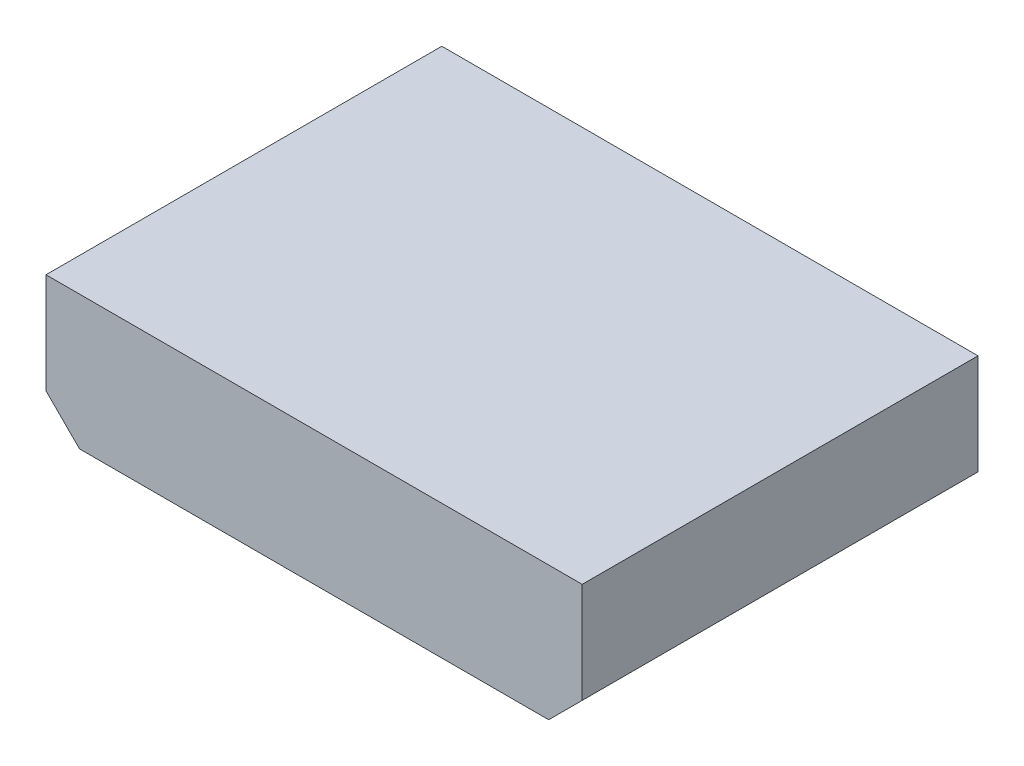
ISO-10303-21;
HEADER;
FILE_DESCRIPTION(('STEP AP214'),'2;1');
FILE_NAME('part.step','',(''),(''),'','','');
FILE_SCHEMA(('AUTOMOTIVE_DESIGN { 1 0 10303 214 1 1 1 1 }'));
ENDSEC;
DATA;
#1=APPLICATION_CONTEXT('core data for automotive mechanical design processes');
#2=APPLICATION_PROTOCOL_DEFINITION('international standard','automotive_design',2000,#1);
#3=PRODUCT_CONTEXT('',#1,'mechanical');
#4=PRODUCT('Part','Part','',(#3));
#5=PRODUCT_RELATED_PRODUCT_CATEGORY('part','',(#4));
#6=PRODUCT_DEFINITION_FORMATION('','',#4);
#7=PRODUCT_DEFINITION_CONTEXT('part definition',#1,'design');
#8=PRODUCT_DEFINITION('design','',#6,#7);
#9=PRODUCT_DEFINITION_SHAPE('','',#8);
#10=(LENGTH_UNIT() NAMED_UNIT(*) SI_UNIT(.MILLI.,.METRE.));
#11=(NAMED_UNIT(*) PLANE_ANGLE_UNIT() SI_UNIT($,.RADIAN.));
#12=(NAMED_UNIT(*) SI_UNIT($,.STERADIAN.) SOLID_ANGLE_UNIT());
#13=UNCERTAINTY_MEASURE_WITH_UNIT(LENGTH_MEASURE(1.E-05),#10,'distance_accuracy_value','');
#14=(GEOMETRIC_REPRESENTATION_CONTEXT(3) GLOBAL_UNCERTAINTY_ASSIGNED_CONTEXT((#13)) GLOBAL_UNIT_ASSIGNED_CONTEXT((#10,
#11,#12)) REPRESENTATION_CONTEXT('',''));
#15=CARTESIAN_POINT('',(0.,0.,0.));
#16=DIRECTION('',(0.,0.,1.));
#17=DIRECTION('',(1.,0.,0.));
#18=AXIS2_PLACEMENT_3D('',#15,#16,#17);
#19=CARTESIAN_POINT('',(10.16,0.,-2.));
#20=DIRECTION('',(0.,0.,1.));
#21=DIRECTION('',(1.,0.,0.));
#22=AXIS2_PLACEMENT_3D('',#19,#20,#21);
#23=CYLINDRICAL_SURFACE('',#22,0.25);
#24=CARTESIAN_POINT('',(10.16,0.,-2.));
#25=DIRECTION('',(0.,0.,1.));
#26=DIRECTION('',(1.,0.,0.));
#27=AXIS2_PLACEMENT_3D('',#24,#25,#26);
#28=CIRCLE('',#27,0.25);
#29=CARTESIAN_POINT('',(10.41,0.,-2.));
#30=VERTEX_POINT('',#29);
#31=EDGE_CURVE('E11',#30,#30,#28,.T.);
#32=ORIENTED_EDGE('',*,*,#31,.T.);
#33=EDGE_LOOP('',(#32));
#34=FACE_BOUND('',#33,.T.);
#35=CARTESIAN_POINT('',(10.16,0.,0.));
#36=DIRECTION('',(0.,0.,1.));
#37=DIRECTION('',(1.,0.,0.));
#38=AXIS2_PLACEMENT_3D('',#35,#36,#37);
#39=CIRCLE('',#38,0.25);
#40=CARTESIAN_POINT('',(10.41,0.,0.));
#41=VERTEX_POINT('',#40);
#42=EDGE_CURVE('E43',#41,#41,#39,.T.);
#43=ORIENTED_EDGE('',*,*,#42,.F.);
#44=EDGE_LOOP('',(#43));
#45=FACE_BOUND('',#44,.T.);
#46=ADVANCED_FACE('F40',(#34,#45),#23,.T.);
#47=CARTESIAN_POINT('',(10.16,0.,-2.));
#48=DIRECTION('',(0.,0.,1.));
#49=DIRECTION('',(1.,0.,0.));
#50=AXIS2_PLACEMENT_3D('',#47,#48,#49);
#51=PLANE('',#50);
#52=ORIENTED_EDGE('',*,*,#31,.F.);
#53=EDGE_LOOP('',(#52));
#54=FACE_BOUND('',#53,.T.);
#55=ADVANCED_FACE('F55',(#54),#51,.F.);
#56=CARTESIAN_POINT('',(10.16,0.,0.));
#57=DIRECTION('',(0.,0.,1.));
#58=DIRECTION('',(1.,0.,0.));
#59=AXIS2_PLACEMENT_3D('',#56,#57,#58);
#60=PLANE('',#59);
#61=ORIENTED_EDGE('',*,*,#42,.T.);
#62=EDGE_LOOP('',(#61));
#63=FACE_BOUND('',#62,.T.);
#64=ADVANCED_FACE('F52',(#63),#60,.T.);
#65=CLOSED_SHELL('',(#46,#55,#64));
#66=MANIFOLD_SOLID_BREP('B2',#65);
#67=CARTESIAN_POINT('',(7.62,0.,-2.));
#68=DIRECTION('',(0.,0.,1.));
#69=DIRECTION('',(1.,0.,0.));
#70=AXIS2_PLACEMENT_3D('',#67,#68,#69);
#71=CYLINDRICAL_SURFACE('',#70,0.25);
#72=CARTESIAN_POINT('',(7.62,0.,-2.));
#73=DIRECTION('',(0.,0.,1.));
#74=DIRECTION('',(1.,0.,0.));
#75=AXIS2_PLACEMENT_3D('',#72,#73,#74);
#76=CIRCLE('',#75,0.25);
#77=CARTESIAN_POINT('',(7.87,0.,-2.));
#78=VERTEX_POINT('',#77);
#79=EDGE_CURVE('E39',#78,#78,#76,.T.);
#80=ORIENTED_EDGE('',*,*,#79,.T.);
#81=EDGE_LOOP('',(#80));
#82=FACE_BOUND('',#81,.T.);
#83=CARTESIAN_POINT('',(7.62,0.,0.));
#84=DIRECTION('',(0.,0.,1.));
#85=DIRECTION('',(1.,0.,0.));
#86=AXIS2_PLACEMENT_3D('',#83,#84,#85);
#87=CIRCLE('',#86,0.25);
#88=CARTESIAN_POINT('',(7.87,0.,0.));
#89=VERTEX_POINT('',#88);
#90=EDGE_CURVE('E92',#89,#89,#87,.T.);
#91=ORIENTED_EDGE('',*,*,#90,.F.);
#92=EDGE_LOOP('',(#91));
#93=FACE_BOUND('',#92,.T.);
#94=ADVANCED_FACE('F89',(#82,#93),#71,.T.);
#95=CARTESIAN_POINT('',(7.62,0.,-2.));
#96=DIRECTION('',(0.,0.,1.));
#97=DIRECTION('',(1.,0.,0.));
#98=AXIS2_PLACEMENT_3D('',#95,#96,#97);
#99=PLANE('',#98);
#100=ORIENTED_EDGE('',*,*,#79,.F.);
#101=EDGE_LOOP('',(#100));
#102=FACE_BOUND('',#101,.T.);
#103=ADVANCED_FACE('F104',(#102),#99,.F.);
#104=CARTESIAN_POINT('',(7.62,0.,0.));
#105=DIRECTION('',(0.,0.,1.));
#106=DIRECTION('',(1.,0.,0.));
#107=AXIS2_PLACEMENT_3D('',#104,#105,#106);
#108=PLANE('',#107);
#109=ORIENTED_EDGE('',*,*,#90,.T.);
#110=EDGE_LOOP('',(#109));
#111=FACE_BOUND('',#110,.T.);
#112=ADVANCED_FACE('F101',(#111),#108,.T.);
#113=CLOSED_SHELL('',(#94,#103,#112));
#114=MANIFOLD_SOLID_BREP('B6',#113);
#115=CARTESIAN_POINT('',(5.08,0.,-2.));
#116=DIRECTION('',(0.,0.,1.));
#117=DIRECTION('',(1.,0.,0.));
#118=AXIS2_PLACEMENT_3D('',#115,#116,#117);
#119=CYLINDRICAL_SURFACE('',#118,0.25);
#120=CARTESIAN_POINT('',(5.08,0.,-2.));
#121=DIRECTION('',(0.,0.,1.));
#122=DIRECTION('',(1.,0.,0.));
#123=AXIS2_PLACEMENT_3D('',#120,#121,#122);
#124=CIRCLE('',#123,0.25);
#125=CARTESIAN_POINT('',(5.33,0.,-2.));
#126=VERTEX_POINT('',#125);
#127=EDGE_CURVE('E88',#126,#126,#124,.T.);
#128=ORIENTED_EDGE('',*,*,#127,.T.);
#129=EDGE_LOOP('',(#128));
#130=FACE_BOUND('',#129,.T.);
#131=CARTESIAN_POINT('',(5.08,0.,0.));
#132=DIRECTION('',(0.,0.,1.));
#133=DIRECTION('',(1.,0.,0.));
#134=AXIS2_PLACEMENT_3D('',#131,#132,#133);
#135=CIRCLE('',#134,0.25);
#136=CARTESIAN_POINT('',(5.33,0.,0.));
#137=VERTEX_POINT('',#136);
#138=EDGE_CURVE('E141',#137,#137,#135,.T.);
#139=ORIENTED_EDGE('',*,*,#138,.F.);
#140=EDGE_LOOP('',(#139));
#141=FACE_BOUND('',#140,.T.);
#142=ADVANCED_FACE('F138',(#130,#141),#119,.T.);
#143=CARTESIAN_POINT('',(5.08,0.,-2.));
#144=DIRECTION('',(0.,0.,1.));
#145=DIRECTION('',(1.,0.,0.));
#146=AXIS2_PLACEMENT_3D('',#143,#144,#145);
#147=PLANE('',#146);
#148=ORIENTED_EDGE('',*,*,#127,.F.);
#149=EDGE_LOOP('',(#148));
#150=FACE_BOUND('',#149,.T.);
#151=ADVANCED_FACE('F153',(#150),#147,.F.);
#152=CARTESIAN_POINT('',(5.08,0.,0.));
#153=DIRECTION('',(0.,0.,1.));
#154=DIRECTION('',(1.,0.,0.));
#155=AXIS2_PLACEMENT_3D('',#152,#153,#154);
#156=PLANE('',#155);
#157=ORIENTED_EDGE('',*,*,#138,.T.);
#158=EDGE_LOOP('',(#157));
#159=FACE_BOUND('',#158,.T.);
#160=ADVANCED_FACE('F150',(#159),#156,.T.);
#161=CLOSED_SHELL('',(#142,#151,#160));
#162=MANIFOLD_SOLID_BREP('B34',#161);
#163=CARTESIAN_POINT('',(2.54,0.,-2.));
#164=DIRECTION('',(0.,0.,1.));
#165=DIRECTION('',(1.,0.,0.));
#166=AXIS2_PLACEMENT_3D('',#163,#164,#165);
#167=CYLINDRICAL_SURFACE('',#166,0.25);
#168=CARTESIAN_POINT('',(2.54,0.,-2.));
#169=DIRECTION('',(0.,0.,1.));
#170=DIRECTION('',(1.,0.,0.));
#171=AXIS2_PLACEMENT_3D('',#168,#169,#170);
#172=CIRCLE('',#171,0.25);
#173=CARTESIAN_POINT('',(2.79,0.,-2.));
#174=VERTEX_POINT('',#173);
#175=EDGE_CURVE('E137',#174,#174,#172,.T.);
#176=ORIENTED_EDGE('',*,*,#175,.T.);
#177=EDGE_LOOP('',(#176));
#178=FACE_BOUND('',#177,.T.);
#179=CARTESIAN_POINT('',(2.54,0.,0.));
#180=DIRECTION('',(0.,0.,1.));
#181=DIRECTION('',(1.,0.,0.));
#182=AXIS2_PLACEMENT_3D('',#179,#180,#181);
#183=CIRCLE('',#182,0.25);
#184=CARTESIAN_POINT('',(2.79,0.,0.));
#185=VERTEX_POINT('',#184);
#186=EDGE_CURVE('E190',#185,#185,#183,.T.);
#187=ORIENTED_EDGE('',*,*,#186,.F.);
#188=EDGE_LOOP('',(#187));
#189=FACE_BOUND('',#188,.T.);
#190=ADVANCED_FACE('F187',(#178,#189),#167,.T.);
#191=CARTESIAN_POINT('',(2.54,0.,-2.));
#192=DIRECTION('',(0.,0.,1.));
#193=DIRECTION('',(1.,0.,0.));
#194=AXIS2_PLACEMENT_3D('',#191,#192,#193);
#195=PLANE('',#194);
#196=ORIENTED_EDGE('',*,*,#175,.F.);
#197=EDGE_LOOP('',(#196));
#198=FACE_BOUND('',#197,.T.);
#199=ADVANCED_FACE('F202',(#198),#195,.F.);
#200=CARTESIAN_POINT('',(2.54,0.,0.));
#201=DIRECTION('',(0.,0.,1.));
#202=DIRECTION('',(1.,0.,0.));
#203=AXIS2_PLACEMENT_3D('',#200,#201,#202);
#204=PLANE('',#203);
#205=ORIENTED_EDGE('',*,*,#186,.T.);
#206=EDGE_LOOP('',(#205));
#207=FACE_BOUND('',#206,.T.);
#208=ADVANCED_FACE('F199',(#207),#204,.T.);
#209=CLOSED_SHELL('',(#190,#199,#208));
#210=MANIFOLD_SOLID_BREP('B83',#209);
#211=CARTESIAN_POINT('',(0.,0.,-2.));
#212=DIRECTION('',(0.,0.,1.));
#213=DIRECTION('',(1.,0.,0.));
#214=AXIS2_PLACEMENT_3D('',#211,#212,#213);
#215=CYLINDRICAL_SURFACE('',#214,0.25);
#216=CARTESIAN_POINT('',(0.,0.,-2.));
#217=DIRECTION('',(0.,0.,1.));
#218=DIRECTION('',(1.,0.,0.));
#219=AXIS2_PLACEMENT_3D('',#216,#217,#218);
#220=CIRCLE('',#219,0.25);
#221=CARTESIAN_POINT('',(0.25,0.,-2.));
#222=VERTEX_POINT('',#221);
#223=EDGE_CURVE('E186',#222,#222,#220,.T.);
#224=ORIENTED_EDGE('',*,*,#223,.T.);
#225=EDGE_LOOP('',(#224));
#226=FACE_BOUND('',#225,.T.);
#227=CARTESIAN_POINT('',(0.,0.,0.));
#228=DIRECTION('',(0.,0.,1.));
#229=DIRECTION('',(1.,0.,0.));
#230=AXIS2_PLACEMENT_3D('',#227,#228,#229);
#231=CIRCLE('',#230,0.25);
#232=CARTESIAN_POINT('',(0.25,0.,0.));
#233=VERTEX_POINT('',#232);
#234=EDGE_CURVE('E240',#233,#233,#231,.T.);
#235=ORIENTED_EDGE('',*,*,#234,.F.);
#236=EDGE_LOOP('',(#235));
#237=FACE_BOUND('',#236,.T.);
#238=ADVANCED_FACE('F237',(#226,#237),#215,.T.);
#239=CARTESIAN_POINT('',(0.,0.,-2.));
#240=DIRECTION('',(0.,0.,1.));
#241=DIRECTION('',(1.,0.,0.));
#242=AXIS2_PLACEMENT_3D('',#239,#240,#241);
#243=PLANE('',#242);
#244=ORIENTED_EDGE('',*,*,#223,.F.);
#245=EDGE_LOOP('',(#244));
#246=FACE_BOUND('',#245,.T.);
#247=ADVANCED_FACE('F252',(#246),#243,.F.);
#248=CARTESIAN_POINT('',(0.,0.,0.));
#249=DIRECTION('',(0.,0.,1.));
#250=DIRECTION('',(1.,0.,0.));
#251=AXIS2_PLACEMENT_3D('',#248,#249,#250);
#252=PLANE('',#251);
#253=ORIENTED_EDGE('',*,*,#234,.T.);
#254=EDGE_LOOP('',(#253));
#255=FACE_BOUND('',#254,.T.);
#256=ADVANCED_FACE('F249',(#255),#252,.T.);
#257=CLOSED_SHELL('',(#238,#247,#256));
#258=MANIFOLD_SOLID_BREP('B132',#257);
#259=CARTESIAN_POINT('',(15.24,2.54,15.));
#260=DIRECTION('',(0.,-1.,0.));
#261=DIRECTION('',(0.,0.,-1.));
#262=AXIS2_PLACEMENT_3D('',#259,#260,#261);
#263=PLANE('',#262);
#264=DIRECTION('',(-1.,0.,0.));
#265=VECTOR('',#264,1.);
#266=CARTESIAN_POINT('',(15.24,2.54,0.));
#267=LINE('',#266,#265);
#268=CARTESIAN_POINT('',(15.24,2.54,0.));
#269=VERTEX_POINT('',#268);
#270=CARTESIAN_POINT('',(-5.08,2.54,0.));
#271=VERTEX_POINT('',#270);
#272=EDGE_CURVE('E362',#269,#271,#267,.T.);
#273=ORIENTED_EDGE('',*,*,#272,.T.);
#274=DIRECTION('',(0.,0.,-1.));
#275=VECTOR('',#274,1.);
#276=CARTESIAN_POINT('',(-5.08,2.54,15.));
#277=LINE('',#276,#275);
#278=CARTESIAN_POINT('',(-5.08,2.54,15.));
#279=VERTEX_POINT('',#278);
#280=EDGE_CURVE('E235',#279,#271,#277,.T.);
#281=ORIENTED_EDGE('',*,*,#280,.F.);
#282=DIRECTION('',(-1.,0.,0.));
#283=VECTOR('',#282,1.);
#284=CARTESIAN_POINT('',(15.24,2.54,15.));
#285=LINE('',#284,#283);
#286=CARTESIAN_POINT('',(15.24,2.54,15.));
#287=VERTEX_POINT('',#286);
#288=EDGE_CURVE('E372',#287,#279,#285,.T.);
#289=ORIENTED_EDGE('',*,*,#288,.F.);
#290=DIRECTION('',(0.,0.,-1.));
#291=VECTOR('',#290,1.);
#292=CARTESIAN_POINT('',(15.24,2.54,15.));
#293=LINE('',#292,#291);
#294=EDGE_CURVE('E358',#287,#269,#293,.T.);
#295=ORIENTED_EDGE('',*,*,#294,.T.);
#296=EDGE_LOOP('',(#273,#281,#289,#295));
#297=FACE_BOUND('',#296,.T.);
#298=ADVANCED_FACE('F278',(#297),#263,.F.);
#299=CARTESIAN_POINT('',(-5.08,2.54,15.));
#300=DIRECTION('',(1.,0.,0.));
#301=DIRECTION('',(0.,0.,-1.));
#302=AXIS2_PLACEMENT_3D('',#299,#300,#301);
#303=PLANE('',#302);
#304=DIRECTION('',(0.,-1.,0.));
#305=VECTOR('',#304,1.);
#306=CARTESIAN_POINT('',(-5.08,2.54,0.));
#307=LINE('',#306,#305);
#308=CARTESIAN_POINT('',(-5.08,-1.27,0.));
#309=VERTEX_POINT('',#308);
#310=EDGE_CURVE('E365',#271,#309,#307,.T.);
#311=ORIENTED_EDGE('',*,*,#310,.T.);
#312=DIRECTION('',(0.,0.,-1.));
#313=VECTOR('',#312,1.);
#314=CARTESIAN_POINT('',(-5.08,-1.27,15.));
#315=LINE('',#314,#313);
#316=CARTESIAN_POINT('',(-5.08,-1.27,15.));
#317=VERTEX_POINT('',#316);
#318=EDGE_CURVE('E286',#317,#309,#315,.T.);
#319=ORIENTED_EDGE('',*,*,#318,.F.);
#320=DIRECTION('',(0.,-1.,0.));
#321=VECTOR('',#320,1.);
#322=CARTESIAN_POINT('',(-5.08,2.54,15.));
#323=LINE('',#322,#321);
#324=EDGE_CURVE('E331',#279,#317,#323,.T.);
#325=ORIENTED_EDGE('',*,*,#324,.F.);
#326=ORIENTED_EDGE('',*,*,#280,.T.);
#327=EDGE_LOOP('',(#311,#319,#325,#326));
#328=FACE_BOUND('',#327,.T.);
#329=ADVANCED_FACE('F396',(#328),#303,.F.);
#330=CARTESIAN_POINT('',(-5.08,-1.27,15.));
#331=DIRECTION('',(0.707106781186547,0.707106781186548,0.));
#332=DIRECTION('',(-0.707106781186548,0.707106781186547,0.));
#333=AXIS2_PLACEMENT_3D('',#330,#331,#332);
#334=PLANE('',#333);
#335=DIRECTION('',(0.707106781186548,-0.707106781186547,0.));
#336=VECTOR('',#335,1.);
#337=CARTESIAN_POINT('',(-5.08,-1.27,0.));
#338=LINE('',#337,#336);
#339=CARTESIAN_POINT('',(-3.81,-2.54,0.));
#340=VERTEX_POINT('',#339);
#341=EDGE_CURVE('E367',#309,#340,#338,.T.);
#342=ORIENTED_EDGE('',*,*,#341,.T.);
#343=DIRECTION('',(0.,0.,-1.));
#344=VECTOR('',#343,1.);
#345=CARTESIAN_POINT('',(-3.81,-2.54,15.));
#346=LINE('',#345,#344);
#347=CARTESIAN_POINT('',(-3.81,-2.54,15.));
#348=VERTEX_POINT('',#347);
#349=EDGE_CURVE('E353',#348,#340,#346,.T.);
#350=ORIENTED_EDGE('',*,*,#349,.F.);
#351=DIRECTION('',(0.707106781186548,-0.707106781186547,0.));
#352=VECTOR('',#351,1.);
#353=CARTESIAN_POINT('',(-5.08,-1.27,15.));
#354=LINE('',#353,#352);
#355=EDGE_CURVE('E344',#317,#348,#354,.T.);
#356=ORIENTED_EDGE('',*,*,#355,.F.);
#357=ORIENTED_EDGE('',*,*,#318,.T.);
#358=EDGE_LOOP('',(#342,#350,#356,#357));
#359=FACE_BOUND('',#358,.T.);
#360=ADVANCED_FACE('F378',(#359),#334,.F.);
#361=CARTESIAN_POINT('',(-3.81,-2.54,15.));
#362=DIRECTION('',(0.,1.,0.));
#363=DIRECTION('',(0.,0.,1.));
#364=AXIS2_PLACEMENT_3D('',#361,#362,#363);
#365=PLANE('',#364);
#366=DIRECTION('',(1.,0.,0.));
#367=VECTOR('',#366,1.);
#368=CARTESIAN_POINT('',(-3.81,-2.54,0.));
#369=LINE('',#368,#367);
#370=CARTESIAN_POINT('',(13.97,-2.54,0.));
#371=VERTEX_POINT('',#370);
#372=EDGE_CURVE('E352',#340,#371,#369,.T.);
#373=ORIENTED_EDGE('',*,*,#372,.T.);
#374=DIRECTION('',(0.,0.,-1.));
#375=VECTOR('',#374,1.);
#376=CARTESIAN_POINT('',(13.97,-2.54,15.));
#377=LINE('',#376,#375);
#378=CARTESIAN_POINT('',(13.97,-2.54,15.));
#379=VERTEX_POINT('',#378);
#380=EDGE_CURVE('E349',#379,#371,#377,.T.);
#381=ORIENTED_EDGE('',*,*,#380,.F.);
#382=DIRECTION('',(1.,0.,0.));
#383=VECTOR('',#382,1.);
#384=CARTESIAN_POINT('',(-3.81,-2.54,15.));
#385=LINE('',#384,#383);
#386=EDGE_CURVE('E338',#348,#379,#385,.T.);
#387=ORIENTED_EDGE('',*,*,#386,.F.);
#388=ORIENTED_EDGE('',*,*,#349,.T.);
#389=EDGE_LOOP('',(#373,#381,#387,#388));
#390=FACE_BOUND('',#389,.T.);
#391=ADVANCED_FACE('F350',(#390),#365,.F.);
#392=CARTESIAN_POINT('',(13.97,-2.54,15.));
#393=DIRECTION('',(-0.707106781186547,0.707106781186548,0.));
#394=DIRECTION('',(-0.707106781186548,-0.707106781186547,0.));
#395=AXIS2_PLACEMENT_3D('',#392,#393,#394);
#396=PLANE('',#395);
#397=DIRECTION('',(0.707106781186548,0.707106781186547,0.));
#398=VECTOR('',#397,1.);
#399=CARTESIAN_POINT('',(13.97,-2.54,0.));
#400=LINE('',#399,#398);
#401=CARTESIAN_POINT('',(15.24,-1.27,0.));
#402=VERTEX_POINT('',#401);
#403=EDGE_CURVE('E317',#371,#402,#400,.T.);
#404=ORIENTED_EDGE('',*,*,#403,.T.);
#405=DIRECTION('',(0.,0.,-1.));
#406=VECTOR('',#405,1.);
#407=CARTESIAN_POINT('',(15.24,-1.27,15.));
#408=LINE('',#407,#406);
#409=CARTESIAN_POINT('',(15.24,-1.27,15.));
#410=VERTEX_POINT('',#409);
#411=EDGE_CURVE('E354',#410,#402,#408,.T.);
#412=ORIENTED_EDGE('',*,*,#411,.F.);
#413=DIRECTION('',(0.707106781186548,0.707106781186547,0.));
#414=VECTOR('',#413,1.);
#415=CARTESIAN_POINT('',(13.97,-2.54,15.));
#416=LINE('',#415,#414);
#417=EDGE_CURVE('E342',#379,#410,#416,.T.);
#418=ORIENTED_EDGE('',*,*,#417,.F.);
#419=ORIENTED_EDGE('',*,*,#380,.T.);
#420=EDGE_LOOP('',(#404,#412,#418,#419));
#421=FACE_BOUND('',#420,.T.);
#422=ADVANCED_FACE('F356',(#421),#396,.F.);
#423=CARTESIAN_POINT('',(15.24,-1.27,15.));
#424=DIRECTION('',(-1.,0.,0.));
#425=DIRECTION('',(0.,0.,1.));
#426=AXIS2_PLACEMENT_3D('',#423,#424,#425);
#427=PLANE('',#426);
#428=DIRECTION('',(0.,1.,0.));
#429=VECTOR('',#428,1.);
#430=CARTESIAN_POINT('',(15.24,-1.27,0.));
#431=LINE('',#430,#429);
#432=EDGE_CURVE('E323',#402,#269,#431,.T.);
#433=ORIENTED_EDGE('',*,*,#432,.T.);
#434=ORIENTED_EDGE('',*,*,#294,.F.);
#435=DIRECTION('',(0.,1.,0.));
#436=VECTOR('',#435,1.);
#437=CARTESIAN_POINT('',(15.24,-1.27,15.));
#438=LINE('',#437,#436);
#439=EDGE_CURVE('E294',#410,#287,#438,.T.);
#440=ORIENTED_EDGE('',*,*,#439,.F.);
#441=ORIENTED_EDGE('',*,*,#411,.T.);
#442=EDGE_LOOP('',(#433,#434,#440,#441));
#443=FACE_BOUND('',#442,.T.);
#444=ADVANCED_FACE('F385',(#443),#427,.F.);
#445=CARTESIAN_POINT('',(0.,0.,15.));
#446=DIRECTION('',(0.,0.,1.));
#447=DIRECTION('',(1.,0.,0.));
#448=AXIS2_PLACEMENT_3D('',#445,#446,#447);
#449=PLANE('',#448);
#450=ORIENTED_EDGE('',*,*,#288,.T.);
#451=ORIENTED_EDGE('',*,*,#324,.T.);
#452=ORIENTED_EDGE('',*,*,#355,.T.);
#453=ORIENTED_EDGE('',*,*,#386,.T.);
#454=ORIENTED_EDGE('',*,*,#417,.T.);
#455=ORIENTED_EDGE('',*,*,#439,.T.);
#456=EDGE_LOOP('',(#450,#451,#452,#453,#454,#455));
#457=FACE_BOUND('',#456,.T.);
#458=ADVANCED_FACE('F340',(#457),#449,.T.);
#459=CARTESIAN_POINT('',(0.,0.,0.));
#460=DIRECTION('',(0.,0.,1.));
#461=DIRECTION('',(1.,0.,0.));
#462=AXIS2_PLACEMENT_3D('',#459,#460,#461);
#463=PLANE('',#462);
#464=ORIENTED_EDGE('',*,*,#272,.F.);
#465=ORIENTED_EDGE('',*,*,#432,.F.);
#466=ORIENTED_EDGE('',*,*,#403,.F.);
#467=ORIENTED_EDGE('',*,*,#372,.F.);
#468=ORIENTED_EDGE('',*,*,#341,.F.);
#469=ORIENTED_EDGE('',*,*,#310,.F.);
#470=EDGE_LOOP('',(#464,#465,#466,#467,#468,#469));
#471=FACE_BOUND('',#470,.T.);
#472=ADVANCED_FACE('F381',(#471),#463,.F.);
#473=CLOSED_SHELL('',(#298,#329,#360,#391,#422,#444,#458,#472));
#474=MANIFOLD_SOLID_BREP('B181',#473);
#475=ADVANCED_BREP_SHAPE_REPRESENTATION('',(#18,#66,#114,#162,#210,#258,#474),#14);
#476=SHAPE_DEFINITION_REPRESENTATION(#9,#475);
ENDSEC;
END-ISO-10303-21;
